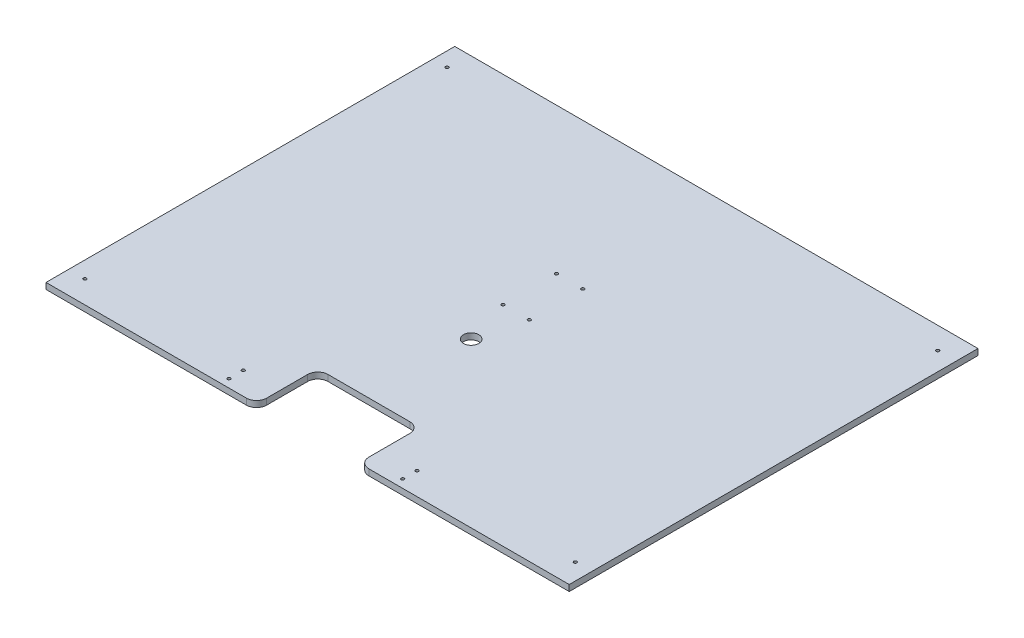
ISO-10303-21;
HEADER;
FILE_DESCRIPTION(('STEP AP214'),'2;1');
FILE_NAME('part.step','',(''),(''),'','','');
FILE_SCHEMA(('AUTOMOTIVE_DESIGN { 1 0 10303 214 1 1 1 1 }'));
ENDSEC;
DATA;
#1=APPLICATION_CONTEXT('core data for automotive mechanical design processes');
#2=APPLICATION_PROTOCOL_DEFINITION('international standard','automotive_design',2000,#1);
#3=PRODUCT_CONTEXT('',#1,'mechanical');
#4=PRODUCT('Part','Part','',(#3));
#5=PRODUCT_RELATED_PRODUCT_CATEGORY('part','',(#4));
#6=PRODUCT_DEFINITION_FORMATION('','',#4);
#7=PRODUCT_DEFINITION_CONTEXT('part definition',#1,'design');
#8=PRODUCT_DEFINITION('design','',#6,#7);
#9=PRODUCT_DEFINITION_SHAPE('','',#8);
#10=(LENGTH_UNIT() NAMED_UNIT(*) SI_UNIT(.MILLI.,.METRE.));
#11=(NAMED_UNIT(*) PLANE_ANGLE_UNIT() SI_UNIT($,.RADIAN.));
#12=(NAMED_UNIT(*) SI_UNIT($,.STERADIAN.) SOLID_ANGLE_UNIT());
#13=UNCERTAINTY_MEASURE_WITH_UNIT(LENGTH_MEASURE(1.E-05),#10,'distance_accuracy_value','');
#14=(GEOMETRIC_REPRESENTATION_CONTEXT(3) GLOBAL_UNCERTAINTY_ASSIGNED_CONTEXT((#13)) GLOBAL_UNIT_ASSIGNED_CONTEXT((#10,
#11,#12)) REPRESENTATION_CONTEXT('',''));
#15=CARTESIAN_POINT('',(0.,0.,0.));
#16=DIRECTION('',(0.,0.,1.));
#17=DIRECTION('',(1.,0.,0.));
#18=AXIS2_PLACEMENT_3D('',#15,#16,#17);
#19=CARTESIAN_POINT('',(0.,6.,0.));
#20=DIRECTION('',(0.,1.,0.));
#21=DIRECTION('',(0.,0.,1.));
#22=AXIS2_PLACEMENT_3D('',#19,#20,#21);
#23=PLANE('',#22);
#24=CARTESIAN_POINT('',(250.,6.,240.));
#25=DIRECTION('',(0.,-1.,0.));
#26=DIRECTION('',(0.,0.,-1.));
#27=AXIS2_PLACEMENT_3D('',#24,#25,#26);
#28=CIRCLE('',#27,7.50000000000001);
#29=CARTESIAN_POINT('',(250.,6.,232.5));
#30=VERTEX_POINT('',#29);
#31=EDGE_CURVE('E161',#30,#30,#28,.T.);
#32=ORIENTED_EDGE('',*,*,#31,.T.);
#33=EDGE_LOOP('',(#32));
#34=FACE_BOUND('',#33,.T.);
#35=CARTESIAN_POINT('',(165.,6.,392.));
#36=DIRECTION('',(0.,1.,0.));
#37=DIRECTION('',(0.,0.,1.));
#38=AXIS2_PLACEMENT_3D('',#35,#36,#37);
#39=CIRCLE('',#38,1.5);
#40=CARTESIAN_POINT('',(165.,6.,393.5));
#41=VERTEX_POINT('',#40);
#42=EDGE_CURVE('E187',#41,#41,#39,.T.);
#43=ORIENTED_EDGE('',*,*,#42,.F.);
#44=EDGE_LOOP('',(#43));
#45=FACE_BOUND('',#44,.T.);
#46=CARTESIAN_POINT('',(335.,6.,378.));
#47=DIRECTION('',(0.,1.,0.));
#48=DIRECTION('',(0.,0.,1.));
#49=AXIS2_PLACEMENT_3D('',#46,#47,#48);
#50=CIRCLE('',#49,1.50000000000002);
#51=CARTESIAN_POINT('',(335.,6.,379.5));
#52=VERTEX_POINT('',#51);
#53=EDGE_CURVE('E186',#52,#52,#50,.T.);
#54=ORIENTED_EDGE('',*,*,#53,.F.);
#55=EDGE_LOOP('',(#54));
#56=FACE_BOUND('',#55,.T.);
#57=CARTESIAN_POINT('',(335.,6.,392.));
#58=DIRECTION('',(0.,1.,0.));
#59=DIRECTION('',(0.,0.,1.));
#60=AXIS2_PLACEMENT_3D('',#57,#58,#59);
#61=CIRCLE('',#60,1.50000000000002);
#62=CARTESIAN_POINT('',(335.,6.,393.5));
#63=VERTEX_POINT('',#62);
#64=EDGE_CURVE('E171',#63,#63,#61,.T.);
#65=ORIENTED_EDGE('',*,*,#64,.F.);
#66=EDGE_LOOP('',(#65));
#67=FACE_BOUND('',#66,.T.);
#68=CARTESIAN_POINT('',(165.,6.,378.));
#69=DIRECTION('',(0.,1.,0.));
#70=DIRECTION('',(0.,0.,1.));
#71=AXIS2_PLACEMENT_3D('',#68,#69,#70);
#72=CIRCLE('',#71,1.5);
#73=CARTESIAN_POINT('',(165.,6.,379.5));
#74=VERTEX_POINT('',#73);
#75=EDGE_CURVE('E190',#74,#74,#72,.T.);
#76=ORIENTED_EDGE('',*,*,#75,.F.);
#77=EDGE_LOOP('',(#76));
#78=FACE_BOUND('',#77,.T.);
#79=CARTESIAN_POINT('',(8.00000000000009,6.,21.5000000000001));
#80=DIRECTION('',(0.,1.,0.));
#81=DIRECTION('',(0.,0.,1.));
#82=AXIS2_PLACEMENT_3D('',#79,#80,#81);
#83=CIRCLE('',#82,1.49999999999999);
#84=CARTESIAN_POINT('',(8.00000000000009,6.,23.0000000000001));
#85=VERTEX_POINT('',#84);
#86=EDGE_CURVE('E204',#85,#85,#83,.T.);
#87=ORIENTED_EDGE('',*,*,#86,.F.);
#88=EDGE_LOOP('',(#87));
#89=FACE_BOUND('',#88,.T.);
#90=CARTESIAN_POINT('',(262.1,6.,142.9));
#91=DIRECTION('',(0.,1.,0.));
#92=DIRECTION('',(0.,0.,1.));
#93=AXIS2_PLACEMENT_3D('',#90,#91,#92);
#94=CIRCLE('',#93,1.50000000000009);
#95=CARTESIAN_POINT('',(262.1,6.,144.4));
#96=VERTEX_POINT('',#95);
#97=EDGE_CURVE('E216',#96,#96,#94,.T.);
#98=ORIENTED_EDGE('',*,*,#97,.F.);
#99=EDGE_LOOP('',(#98));
#100=FACE_BOUND('',#99,.T.);
#101=CARTESIAN_POINT('',(236.4,6.,195.2));
#102=DIRECTION('',(0.,1.,0.));
#103=DIRECTION('',(0.,0.,1.));
#104=AXIS2_PLACEMENT_3D('',#101,#102,#103);
#105=CIRCLE('',#104,1.50000000000009);
#106=CARTESIAN_POINT('',(236.4,6.,196.7));
#107=VERTEX_POINT('',#106);
#108=EDGE_CURVE('E228',#107,#107,#105,.T.);
#109=ORIENTED_EDGE('',*,*,#108,.F.);
#110=EDGE_LOOP('',(#109));
#111=FACE_BOUND('',#110,.T.);
#112=CARTESIAN_POINT('',(490.,6.,378.));
#113=DIRECTION('',(0.,1.,0.));
#114=DIRECTION('',(0.,0.,1.));
#115=AXIS2_PLACEMENT_3D('',#112,#113,#114);
#116=CIRCLE('',#115,1.50000000000002);
#117=CARTESIAN_POINT('',(490.,6.,379.5));
#118=VERTEX_POINT('',#117);
#119=EDGE_CURVE('E240',#118,#118,#116,.T.);
#120=ORIENTED_EDGE('',*,*,#119,.F.);
#121=EDGE_LOOP('',(#120));
#122=FACE_BOUND('',#121,.T.);
#123=CARTESIAN_POINT('',(10.,6.,378.));
#124=DIRECTION('',(0.,1.,0.));
#125=DIRECTION('',(0.,0.,1.));
#126=AXIS2_PLACEMENT_3D('',#123,#124,#125);
#127=CIRCLE('',#126,1.49999999999999);
#128=CARTESIAN_POINT('',(10.,6.,379.5));
#129=VERTEX_POINT('',#128);
#130=EDGE_CURVE('E234',#129,#129,#127,.T.);
#131=ORIENTED_EDGE('',*,*,#130,.F.);
#132=EDGE_LOOP('',(#131));
#133=FACE_BOUND('',#132,.T.);
#134=CARTESIAN_POINT('',(262.1,6.,195.2));
#135=DIRECTION('',(0.,1.,0.));
#136=DIRECTION('',(0.,0.,1.));
#137=AXIS2_PLACEMENT_3D('',#134,#135,#136);
#138=CIRCLE('',#137,1.50000000000009);
#139=CARTESIAN_POINT('',(262.1,6.,196.7));
#140=VERTEX_POINT('',#139);
#141=EDGE_CURVE('E222',#140,#140,#138,.T.);
#142=ORIENTED_EDGE('',*,*,#141,.F.);
#143=EDGE_LOOP('',(#142));
#144=FACE_BOUND('',#143,.T.);
#145=CARTESIAN_POINT('',(236.4,6.,142.9));
#146=DIRECTION('',(0.,1.,0.));
#147=DIRECTION('',(0.,0.,1.));
#148=AXIS2_PLACEMENT_3D('',#145,#146,#147);
#149=CIRCLE('',#148,1.50000000000009);
#150=CARTESIAN_POINT('',(236.4,6.,144.4));
#151=VERTEX_POINT('',#150);
#152=EDGE_CURVE('E210',#151,#151,#149,.T.);
#153=ORIENTED_EDGE('',*,*,#152,.F.);
#154=EDGE_LOOP('',(#153));
#155=FACE_BOUND('',#154,.T.);
#156=CARTESIAN_POINT('',(488.,6.,21.5000000000001));
#157=DIRECTION('',(0.,1.,0.));
#158=DIRECTION('',(0.,0.,1.));
#159=AXIS2_PLACEMENT_3D('',#156,#157,#158);
#160=CIRCLE('',#159,1.52499999999998);
#161=CARTESIAN_POINT('',(488.,6.,23.0250000000001));
#162=VERTEX_POINT('',#161);
#163=EDGE_CURVE('E196',#162,#162,#160,.T.);
#164=ORIENTED_EDGE('',*,*,#163,.F.);
#165=EDGE_LOOP('',(#164));
#166=FACE_BOUND('',#165,.T.);
#167=DIRECTION('',(1.,0.,0.));
#168=VECTOR('',#167,1.);
#169=CARTESIAN_POINT('',(0.,6.,400.));
#170=LINE('',#169,#168);
#171=CARTESIAN_POINT('',(-5.99999999999997,6.00000000000006,400.));
#172=VERTEX_POINT('',#171);
#173=CARTESIAN_POINT('',(190.,6.,400.));
#174=VERTEX_POINT('',#173);
#175=EDGE_CURVE('E134',#172,#174,#170,.T.);
#176=ORIENTED_EDGE('',*,*,#175,.T.);
#177=CARTESIAN_POINT('',(190.,6.,390.));
#178=DIRECTION('',(0.,1.,0.));
#179=DIRECTION('',(0.,0.,1.));
#180=AXIS2_PLACEMENT_3D('',#177,#178,#179);
#181=CIRCLE('',#180,10.);
#182=CARTESIAN_POINT('',(200.,6.,390.));
#183=VERTEX_POINT('',#182);
#184=EDGE_CURVE('E273',#174,#183,#181,.T.);
#185=ORIENTED_EDGE('',*,*,#184,.T.);
#186=DIRECTION('',(0.,0.,1.));
#187=VECTOR('',#186,1.);
#188=CARTESIAN_POINT('',(200.,6.,0.));
#189=LINE('',#188,#187);
#190=CARTESIAN_POINT('',(200.,6.,350.));
#191=VERTEX_POINT('',#190);
#192=EDGE_CURVE('E168',#191,#183,#189,.T.);
#193=ORIENTED_EDGE('',*,*,#192,.F.);
#194=CARTESIAN_POINT('',(210.,6.,350.));
#195=DIRECTION('',(0.,1.,0.));
#196=DIRECTION('',(0.,0.,1.));
#197=AXIS2_PLACEMENT_3D('',#194,#195,#196);
#198=CIRCLE('',#197,10.);
#199=CARTESIAN_POINT('',(210.,6.,340.));
#200=VERTEX_POINT('',#199);
#201=EDGE_CURVE('E289',#191,#200,#198,.F.);
#202=ORIENTED_EDGE('',*,*,#201,.T.);
#203=DIRECTION('',(-1.,0.,0.));
#204=VECTOR('',#203,1.);
#205=CARTESIAN_POINT('',(0.,6.,340.));
#206=LINE('',#205,#204);
#207=CARTESIAN_POINT('',(290.,6.,340.));
#208=VERTEX_POINT('',#207);
#209=EDGE_CURVE('E162',#208,#200,#206,.T.);
#210=ORIENTED_EDGE('',*,*,#209,.F.);
#211=CARTESIAN_POINT('',(290.,6.,350.));
#212=DIRECTION('',(0.,1.,0.));
#213=DIRECTION('',(0.,0.,1.));
#214=AXIS2_PLACEMENT_3D('',#211,#212,#213);
#215=CIRCLE('',#214,10.);
#216=CARTESIAN_POINT('',(300.,6.,350.));
#217=VERTEX_POINT('',#216);
#218=EDGE_CURVE('E11',#208,#217,#215,.F.);
#219=ORIENTED_EDGE('',*,*,#218,.T.);
#220=DIRECTION('',(0.,0.,1.));
#221=VECTOR('',#220,1.);
#222=CARTESIAN_POINT('',(300.,6.,0.));
#223=LINE('',#222,#221);
#224=CARTESIAN_POINT('',(300.,6.,390.));
#225=VERTEX_POINT('',#224);
#226=EDGE_CURVE('E165',#217,#225,#223,.T.);
#227=ORIENTED_EDGE('',*,*,#226,.T.);
#228=CARTESIAN_POINT('',(310.,6.,390.));
#229=DIRECTION('',(0.,1.,0.));
#230=DIRECTION('',(0.,0.,1.));
#231=AXIS2_PLACEMENT_3D('',#228,#229,#230);
#232=CIRCLE('',#231,10.);
#233=CARTESIAN_POINT('',(310.,6.,400.));
#234=VERTEX_POINT('',#233);
#235=EDGE_CURVE('E48',#225,#234,#232,.T.);
#236=ORIENTED_EDGE('',*,*,#235,.T.);
#237=CARTESIAN_POINT('',(506.,6.00000000000006,400.));
#238=VERTEX_POINT('',#237);
#239=EDGE_CURVE('E139',#234,#238,#170,.T.);
#240=ORIENTED_EDGE('',*,*,#239,.T.);
#241=DIRECTION('',(0.,0.,1.));
#242=VECTOR('',#241,1.);
#243=CARTESIAN_POINT('',(506.,6.00000000000006,400.));
#244=LINE('',#243,#242);
#245=CARTESIAN_POINT('',(506.,6.00000000000001,0.));
#246=VERTEX_POINT('',#245);
#247=EDGE_CURVE('E137',#246,#238,#244,.T.);
#248=ORIENTED_EDGE('',*,*,#247,.F.);
#249=DIRECTION('',(-1.,0.,0.));
#250=VECTOR('',#249,1.);
#251=CARTESIAN_POINT('',(0.,6.,0.));
#252=LINE('',#251,#250);
#253=CARTESIAN_POINT('',(-5.99999999999992,6.00000000000001,0.));
#254=VERTEX_POINT('',#253);
#255=EDGE_CURVE('E123',#246,#254,#252,.T.);
#256=ORIENTED_EDGE('',*,*,#255,.T.);
#257=DIRECTION('',(0.,0.,-1.));
#258=VECTOR('',#257,1.);
#259=CARTESIAN_POINT('',(-5.99999999999997,6.00000000000006,400.));
#260=LINE('',#259,#258);
#261=EDGE_CURVE('E157',#172,#254,#260,.T.);
#262=ORIENTED_EDGE('',*,*,#261,.F.);
#263=EDGE_LOOP('',(#176,#185,#193,#202,#210,#219,#227,#236,#240,#248,#256,#262));
#264=FACE_BOUND('',#263,.T.);
#265=ADVANCED_FACE('F33',(#34,#45,#56,#67,#78,#89,#100,#111,#122,#133,#144,#155,#166,#264),#23,.T.);
#266=CARTESIAN_POINT('',(0.,0.,0.));
#267=DIRECTION('',(0.,1.,0.));
#268=DIRECTION('',(0.,0.,1.));
#269=AXIS2_PLACEMENT_3D('',#266,#267,#268);
#270=PLANE('',#269);
#271=CARTESIAN_POINT('',(488.,0.,21.5000000000001));
#272=DIRECTION('',(0.,1.,0.));
#273=DIRECTION('',(0.,0.,1.));
#274=AXIS2_PLACEMENT_3D('',#271,#272,#273);
#275=CIRCLE('',#274,1.52499999999998);
#276=CARTESIAN_POINT('',(488.,0.,23.0250000000001));
#277=VERTEX_POINT('',#276);
#278=EDGE_CURVE('E200',#277,#277,#275,.T.);
#279=ORIENTED_EDGE('',*,*,#278,.T.);
#280=EDGE_LOOP('',(#279));
#281=FACE_BOUND('',#280,.T.);
#282=CARTESIAN_POINT('',(8.00000000000009,0.,21.5000000000001));
#283=DIRECTION('',(0.,1.,0.));
#284=DIRECTION('',(0.,0.,1.));
#285=AXIS2_PLACEMENT_3D('',#282,#283,#284);
#286=CIRCLE('',#285,1.49999999999999);
#287=CARTESIAN_POINT('',(8.00000000000009,0.,23.0000000000001));
#288=VERTEX_POINT('',#287);
#289=EDGE_CURVE('E199',#288,#288,#286,.T.);
#290=ORIENTED_EDGE('',*,*,#289,.T.);
#291=EDGE_LOOP('',(#290));
#292=FACE_BOUND('',#291,.T.);
#293=CARTESIAN_POINT('',(236.4,0.,142.9));
#294=DIRECTION('',(0.,1.,0.));
#295=DIRECTION('',(0.,0.,1.));
#296=AXIS2_PLACEMENT_3D('',#293,#294,#295);
#297=CIRCLE('',#296,1.50000000000009);
#298=CARTESIAN_POINT('',(236.4,0.,144.4));
#299=VERTEX_POINT('',#298);
#300=EDGE_CURVE('E207',#299,#299,#297,.T.);
#301=ORIENTED_EDGE('',*,*,#300,.T.);
#302=EDGE_LOOP('',(#301));
#303=FACE_BOUND('',#302,.T.);
#304=CARTESIAN_POINT('',(262.1,0.,142.9));
#305=DIRECTION('',(0.,1.,0.));
#306=DIRECTION('',(0.,0.,1.));
#307=AXIS2_PLACEMENT_3D('',#304,#305,#306);
#308=CIRCLE('',#307,1.50000000000009);
#309=CARTESIAN_POINT('',(262.1,0.,144.4));
#310=VERTEX_POINT('',#309);
#311=EDGE_CURVE('E213',#310,#310,#308,.T.);
#312=ORIENTED_EDGE('',*,*,#311,.T.);
#313=EDGE_LOOP('',(#312));
#314=FACE_BOUND('',#313,.T.);
#315=CARTESIAN_POINT('',(262.1,0.,195.2));
#316=DIRECTION('',(0.,1.,0.));
#317=DIRECTION('',(0.,0.,1.));
#318=AXIS2_PLACEMENT_3D('',#315,#316,#317);
#319=CIRCLE('',#318,1.50000000000009);
#320=CARTESIAN_POINT('',(262.1,0.,196.7));
#321=VERTEX_POINT('',#320);
#322=EDGE_CURVE('E219',#321,#321,#319,.T.);
#323=ORIENTED_EDGE('',*,*,#322,.T.);
#324=EDGE_LOOP('',(#323));
#325=FACE_BOUND('',#324,.T.);
#326=CARTESIAN_POINT('',(236.4,0.,195.2));
#327=DIRECTION('',(0.,1.,0.));
#328=DIRECTION('',(0.,0.,1.));
#329=AXIS2_PLACEMENT_3D('',#326,#327,#328);
#330=CIRCLE('',#329,1.50000000000009);
#331=CARTESIAN_POINT('',(236.4,0.,196.7));
#332=VERTEX_POINT('',#331);
#333=EDGE_CURVE('E225',#332,#332,#330,.T.);
#334=ORIENTED_EDGE('',*,*,#333,.T.);
#335=EDGE_LOOP('',(#334));
#336=FACE_BOUND('',#335,.T.);
#337=CARTESIAN_POINT('',(10.,0.,378.));
#338=DIRECTION('',(0.,1.,0.));
#339=DIRECTION('',(0.,0.,1.));
#340=AXIS2_PLACEMENT_3D('',#337,#338,#339);
#341=CIRCLE('',#340,1.49999999999999);
#342=CARTESIAN_POINT('',(10.,0.,379.5));
#343=VERTEX_POINT('',#342);
#344=EDGE_CURVE('E231',#343,#343,#341,.T.);
#345=ORIENTED_EDGE('',*,*,#344,.T.);
#346=EDGE_LOOP('',(#345));
#347=FACE_BOUND('',#346,.T.);
#348=CARTESIAN_POINT('',(490.,0.,378.));
#349=DIRECTION('',(0.,1.,0.));
#350=DIRECTION('',(0.,0.,1.));
#351=AXIS2_PLACEMENT_3D('',#348,#349,#350);
#352=CIRCLE('',#351,1.50000000000002);
#353=CARTESIAN_POINT('',(490.,0.,379.5));
#354=VERTEX_POINT('',#353);
#355=EDGE_CURVE('E237',#354,#354,#352,.T.);
#356=ORIENTED_EDGE('',*,*,#355,.T.);
#357=EDGE_LOOP('',(#356));
#358=FACE_BOUND('',#357,.T.);
#359=CARTESIAN_POINT('',(165.,0.,378.));
#360=DIRECTION('',(0.,1.,0.));
#361=DIRECTION('',(0.,0.,1.));
#362=AXIS2_PLACEMENT_3D('',#359,#360,#361);
#363=CIRCLE('',#362,1.5);
#364=CARTESIAN_POINT('',(165.,0.,379.5));
#365=VERTEX_POINT('',#364);
#366=EDGE_CURVE('E195',#365,#365,#363,.T.);
#367=ORIENTED_EDGE('',*,*,#366,.T.);
#368=EDGE_LOOP('',(#367));
#369=FACE_BOUND('',#368,.T.);
#370=CARTESIAN_POINT('',(335.,0.,392.));
#371=DIRECTION('',(0.,1.,0.));
#372=DIRECTION('',(0.,0.,1.));
#373=AXIS2_PLACEMENT_3D('',#370,#371,#372);
#374=CIRCLE('',#373,1.50000000000002);
#375=CARTESIAN_POINT('',(335.,0.,393.5));
#376=VERTEX_POINT('',#375);
#377=EDGE_CURVE('E254',#376,#376,#374,.T.);
#378=ORIENTED_EDGE('',*,*,#377,.T.);
#379=EDGE_LOOP('',(#378));
#380=FACE_BOUND('',#379,.T.);
#381=CARTESIAN_POINT('',(335.,0.,378.));
#382=DIRECTION('',(0.,1.,0.));
#383=DIRECTION('',(0.,0.,1.));
#384=AXIS2_PLACEMENT_3D('',#381,#382,#383);
#385=CIRCLE('',#384,1.50000000000002);
#386=CARTESIAN_POINT('',(335.,0.,379.5));
#387=VERTEX_POINT('',#386);
#388=EDGE_CURVE('E257',#387,#387,#385,.T.);
#389=ORIENTED_EDGE('',*,*,#388,.T.);
#390=EDGE_LOOP('',(#389));
#391=FACE_BOUND('',#390,.T.);
#392=CARTESIAN_POINT('',(165.,0.,392.));
#393=DIRECTION('',(0.,1.,0.));
#394=DIRECTION('',(0.,0.,1.));
#395=AXIS2_PLACEMENT_3D('',#392,#393,#394);
#396=CIRCLE('',#395,1.5);
#397=CARTESIAN_POINT('',(165.,0.,393.5));
#398=VERTEX_POINT('',#397);
#399=EDGE_CURVE('E203',#398,#398,#396,.T.);
#400=ORIENTED_EDGE('',*,*,#399,.T.);
#401=EDGE_LOOP('',(#400));
#402=FACE_BOUND('',#401,.T.);
#403=CARTESIAN_POINT('',(250.,0.,240.));
#404=DIRECTION('',(0.,-1.,0.));
#405=DIRECTION('',(0.,0.,-1.));
#406=AXIS2_PLACEMENT_3D('',#403,#404,#405);
#407=CIRCLE('',#406,7.50000000000001);
#408=CARTESIAN_POINT('',(250.,0.,232.5));
#409=VERTEX_POINT('',#408);
#410=EDGE_CURVE('E176',#409,#409,#407,.T.);
#411=ORIENTED_EDGE('',*,*,#410,.F.);
#412=EDGE_LOOP('',(#411));
#413=FACE_BOUND('',#412,.T.);
#414=DIRECTION('',(0.,0.,1.));
#415=VECTOR('',#414,1.);
#416=CARTESIAN_POINT('',(200.,0.,0.));
#417=LINE('',#416,#415);
#418=CARTESIAN_POINT('',(200.,0.,350.));
#419=VERTEX_POINT('',#418);
#420=CARTESIAN_POINT('',(200.,0.,390.));
#421=VERTEX_POINT('',#420);
#422=EDGE_CURVE('E166',#419,#421,#417,.T.);
#423=ORIENTED_EDGE('',*,*,#422,.T.);
#424=CARTESIAN_POINT('',(190.,0.,390.));
#425=DIRECTION('',(0.,1.,0.));
#426=DIRECTION('',(0.,0.,1.));
#427=AXIS2_PLACEMENT_3D('',#424,#425,#426);
#428=CIRCLE('',#427,10.);
#429=CARTESIAN_POINT('',(190.,0.,400.));
#430=VERTEX_POINT('',#429);
#431=EDGE_CURVE('E268',#421,#430,#428,.F.);
#432=ORIENTED_EDGE('',*,*,#431,.T.);
#433=DIRECTION('',(1.,0.,0.));
#434=VECTOR('',#433,1.);
#435=CARTESIAN_POINT('',(0.,0.,400.));
#436=LINE('',#435,#434);
#437=CARTESIAN_POINT('',(-5.99999999999997,0.,400.));
#438=VERTEX_POINT('',#437);
#439=EDGE_CURVE('E247',#438,#430,#436,.T.);
#440=ORIENTED_EDGE('',*,*,#439,.F.);
#441=DIRECTION('',(0.,0.,-1.));
#442=VECTOR('',#441,1.);
#443=CARTESIAN_POINT('',(-5.99999999999997,0.,400.));
#444=LINE('',#443,#442);
#445=CARTESIAN_POINT('',(-5.99999999999997,0.,0.));
#446=VERTEX_POINT('',#445);
#447=EDGE_CURVE('E152',#438,#446,#444,.T.);
#448=ORIENTED_EDGE('',*,*,#447,.T.);
#449=DIRECTION('',(-1.,0.,0.));
#450=VECTOR('',#449,1.);
#451=CARTESIAN_POINT('',(0.,0.,0.));
#452=LINE('',#451,#450);
#453=CARTESIAN_POINT('',(506.,0.,0.));
#454=VERTEX_POINT('',#453);
#455=EDGE_CURVE('E250',#454,#446,#452,.T.);
#456=ORIENTED_EDGE('',*,*,#455,.F.);
#457=DIRECTION('',(0.,0.,1.));
#458=VECTOR('',#457,1.);
#459=CARTESIAN_POINT('',(506.,0.,400.));
#460=LINE('',#459,#458);
#461=CARTESIAN_POINT('',(506.,0.,400.));
#462=VERTEX_POINT('',#461);
#463=EDGE_CURVE('E147',#454,#462,#460,.T.);
#464=ORIENTED_EDGE('',*,*,#463,.T.);
#465=CARTESIAN_POINT('',(310.,0.,400.));
#466=VERTEX_POINT('',#465);
#467=EDGE_CURVE('E243',#466,#462,#436,.T.);
#468=ORIENTED_EDGE('',*,*,#467,.F.);
#469=CARTESIAN_POINT('',(310.,0.,390.));
#470=DIRECTION('',(0.,1.,0.));
#471=DIRECTION('',(0.,0.,1.));
#472=AXIS2_PLACEMENT_3D('',#469,#470,#471);
#473=CIRCLE('',#472,10.);
#474=CARTESIAN_POINT('',(300.,0.,390.));
#475=VERTEX_POINT('',#474);
#476=EDGE_CURVE('E266',#466,#475,#473,.F.);
#477=ORIENTED_EDGE('',*,*,#476,.T.);
#478=DIRECTION('',(0.,0.,1.));
#479=VECTOR('',#478,1.);
#480=CARTESIAN_POINT('',(300.,0.,0.));
#481=LINE('',#480,#479);
#482=CARTESIAN_POINT('',(300.,0.,350.));
#483=VERTEX_POINT('',#482);
#484=EDGE_CURVE('E175',#483,#475,#481,.T.);
#485=ORIENTED_EDGE('',*,*,#484,.F.);
#486=CARTESIAN_POINT('',(290.,0.,350.));
#487=DIRECTION('',(0.,1.,0.));
#488=DIRECTION('',(0.,0.,1.));
#489=AXIS2_PLACEMENT_3D('',#486,#487,#488);
#490=CIRCLE('',#489,10.);
#491=CARTESIAN_POINT('',(290.,0.,340.));
#492=VERTEX_POINT('',#491);
#493=EDGE_CURVE('E41',#483,#492,#490,.T.);
#494=ORIENTED_EDGE('',*,*,#493,.T.);
#495=DIRECTION('',(-1.,0.,0.));
#496=VECTOR('',#495,1.);
#497=CARTESIAN_POINT('',(0.,0.,340.));
#498=LINE('',#497,#496);
#499=CARTESIAN_POINT('',(210.,0.,340.));
#500=VERTEX_POINT('',#499);
#501=EDGE_CURVE('E172',#492,#500,#498,.T.);
#502=ORIENTED_EDGE('',*,*,#501,.T.);
#503=CARTESIAN_POINT('',(210.,0.,350.));
#504=DIRECTION('',(0.,1.,0.));
#505=DIRECTION('',(0.,0.,1.));
#506=AXIS2_PLACEMENT_3D('',#503,#504,#505);
#507=CIRCLE('',#506,10.);
#508=EDGE_CURVE('E287',#500,#419,#507,.T.);
#509=ORIENTED_EDGE('',*,*,#508,.T.);
#510=EDGE_LOOP('',(#423,#432,#440,#448,#456,#464,#468,#477,#485,#494,#502,#509));
#511=FACE_BOUND('',#510,.T.);
#512=ADVANCED_FACE('F293',(#281,#292,#303,#314,#325,#336,#347,#358,#369,#380,#391,#402,#413,
#511),#270,.F.);
#513=CARTESIAN_POINT('',(0.,6.,400.));
#514=DIRECTION('',(0.,0.,-1.));
#515=DIRECTION('',(-1.,0.,0.));
#516=AXIS2_PLACEMENT_3D('',#513,#514,#515);
#517=PLANE('',#516);
#518=ORIENTED_EDGE('',*,*,#439,.T.);
#519=DIRECTION('',(0.,-1.,0.));
#520=VECTOR('',#519,1.);
#521=CARTESIAN_POINT('',(190.,6.,400.));
#522=LINE('',#521,#520);
#523=EDGE_CURVE('E270',#430,#174,#522,.F.);
#524=ORIENTED_EDGE('',*,*,#523,.T.);
#525=ORIENTED_EDGE('',*,*,#175,.F.);
#526=DIRECTION('',(0.,-1.,0.));
#527=VECTOR('',#526,1.);
#528=CARTESIAN_POINT('',(-5.99999999999997,406.044997469035,400.));
#529=LINE('',#528,#527);
#530=EDGE_CURVE('E155',#172,#438,#529,.T.);
#531=ORIENTED_EDGE('',*,*,#530,.T.);
#532=EDGE_LOOP('',(#518,#524,#525,#531));
#533=FACE_BOUND('',#532,.T.);
#534=ADVANCED_FACE('F339',(#533),#517,.F.);
#535=ORIENTED_EDGE('',*,*,#239,.F.);
#536=DIRECTION('',(0.,-1.,0.));
#537=VECTOR('',#536,1.);
#538=CARTESIAN_POINT('',(310.,6.,400.));
#539=LINE('',#538,#537);
#540=EDGE_CURVE('E275',#234,#466,#539,.T.);
#541=ORIENTED_EDGE('',*,*,#540,.T.);
#542=ORIENTED_EDGE('',*,*,#467,.T.);
#543=DIRECTION('',(0.,-1.,0.));
#544=VECTOR('',#543,1.);
#545=CARTESIAN_POINT('',(506.,406.044997469035,400.));
#546=LINE('',#545,#544);
#547=EDGE_CURVE('E143',#238,#462,#546,.T.);
#548=ORIENTED_EDGE('',*,*,#547,.F.);
#549=EDGE_LOOP('',(#535,#541,#542,#548));
#550=FACE_BOUND('',#549,.T.);
#551=ADVANCED_FACE('F308',(#550),#517,.F.);
#552=CARTESIAN_POINT('',(0.,6.,0.));
#553=DIRECTION('',(0.,0.,1.));
#554=DIRECTION('',(1.,0.,0.));
#555=AXIS2_PLACEMENT_3D('',#552,#553,#554);
#556=PLANE('',#555);
#557=ORIENTED_EDGE('',*,*,#455,.T.);
#558=DIRECTION('',(0.,-1.,0.));
#559=VECTOR('',#558,1.);
#560=CARTESIAN_POINT('',(-5.99999999999997,406.044997469035,0.));
#561=LINE('',#560,#559);
#562=EDGE_CURVE('E130',#254,#446,#561,.T.);
#563=ORIENTED_EDGE('',*,*,#562,.F.);
#564=ORIENTED_EDGE('',*,*,#255,.F.);
#565=DIRECTION('',(0.,-1.,0.));
#566=VECTOR('',#565,1.);
#567=CARTESIAN_POINT('',(506.,406.044997469035,0.));
#568=LINE('',#567,#566);
#569=EDGE_CURVE('E127',#246,#454,#568,.T.);
#570=ORIENTED_EDGE('',*,*,#569,.T.);
#571=EDGE_LOOP('',(#557,#563,#564,#570));
#572=FACE_BOUND('',#571,.T.);
#573=ADVANCED_FACE('F125',(#572),#556,.F.);
#574=CARTESIAN_POINT('',(490.,6.,378.));
#575=DIRECTION('',(0.,-1.,0.));
#576=DIRECTION('',(0.,0.,-1.));
#577=AXIS2_PLACEMENT_3D('',#574,#575,#576);
#578=CYLINDRICAL_SURFACE('',#577,1.50000000000002);
#579=ORIENTED_EDGE('',*,*,#119,.T.);
#580=EDGE_LOOP('',(#579));
#581=FACE_BOUND('',#580,.T.);
#582=ORIENTED_EDGE('',*,*,#355,.F.);
#583=EDGE_LOOP('',(#582));
#584=FACE_BOUND('',#583,.T.);
#585=ADVANCED_FACE('F344',(#581,#584),#578,.F.);
#586=CARTESIAN_POINT('',(10.,6.,378.));
#587=DIRECTION('',(0.,-1.,0.));
#588=DIRECTION('',(0.,0.,-1.));
#589=AXIS2_PLACEMENT_3D('',#586,#587,#588);
#590=CYLINDRICAL_SURFACE('',#589,1.49999999999999);
#591=ORIENTED_EDGE('',*,*,#130,.T.);
#592=EDGE_LOOP('',(#591));
#593=FACE_BOUND('',#592,.T.);
#594=ORIENTED_EDGE('',*,*,#344,.F.);
#595=EDGE_LOOP('',(#594));
#596=FACE_BOUND('',#595,.T.);
#597=ADVANCED_FACE('F404',(#593,#596),#590,.F.);
#598=CARTESIAN_POINT('',(236.4,6.,195.2));
#599=DIRECTION('',(0.,-1.,0.));
#600=DIRECTION('',(0.,0.,-1.));
#601=AXIS2_PLACEMENT_3D('',#598,#599,#600);
#602=CYLINDRICAL_SURFACE('',#601,1.50000000000009);
#603=ORIENTED_EDGE('',*,*,#108,.T.);
#604=EDGE_LOOP('',(#603));
#605=FACE_BOUND('',#604,.T.);
#606=ORIENTED_EDGE('',*,*,#333,.F.);
#607=EDGE_LOOP('',(#606));
#608=FACE_BOUND('',#607,.T.);
#609=ADVANCED_FACE('F401',(#605,#608),#602,.F.);
#610=CARTESIAN_POINT('',(262.1,6.,195.2));
#611=DIRECTION('',(0.,-1.,0.));
#612=DIRECTION('',(0.,0.,-1.));
#613=AXIS2_PLACEMENT_3D('',#610,#611,#612);
#614=CYLINDRICAL_SURFACE('',#613,1.50000000000009);
#615=ORIENTED_EDGE('',*,*,#141,.T.);
#616=EDGE_LOOP('',(#615));
#617=FACE_BOUND('',#616,.T.);
#618=ORIENTED_EDGE('',*,*,#322,.F.);
#619=EDGE_LOOP('',(#618));
#620=FACE_BOUND('',#619,.T.);
#621=ADVANCED_FACE('F397',(#617,#620),#614,.F.);
#622=CARTESIAN_POINT('',(262.1,6.,142.9));
#623=DIRECTION('',(0.,-1.,0.));
#624=DIRECTION('',(0.,0.,-1.));
#625=AXIS2_PLACEMENT_3D('',#622,#623,#624);
#626=CYLINDRICAL_SURFACE('',#625,1.50000000000009);
#627=ORIENTED_EDGE('',*,*,#97,.T.);
#628=EDGE_LOOP('',(#627));
#629=FACE_BOUND('',#628,.T.);
#630=ORIENTED_EDGE('',*,*,#311,.F.);
#631=EDGE_LOOP('',(#630));
#632=FACE_BOUND('',#631,.T.);
#633=ADVANCED_FACE('F393',(#629,#632),#626,.F.);
#634=CARTESIAN_POINT('',(236.4,6.,142.9));
#635=DIRECTION('',(0.,-1.,0.));
#636=DIRECTION('',(0.,0.,-1.));
#637=AXIS2_PLACEMENT_3D('',#634,#635,#636);
#638=CYLINDRICAL_SURFACE('',#637,1.50000000000009);
#639=ORIENTED_EDGE('',*,*,#152,.T.);
#640=EDGE_LOOP('',(#639));
#641=FACE_BOUND('',#640,.T.);
#642=ORIENTED_EDGE('',*,*,#300,.F.);
#643=EDGE_LOOP('',(#642));
#644=FACE_BOUND('',#643,.T.);
#645=ADVANCED_FACE('F389',(#641,#644),#638,.F.);
#646=CARTESIAN_POINT('',(8.00000000000009,6.,21.5000000000001));
#647=DIRECTION('',(0.,-1.,0.));
#648=DIRECTION('',(0.,0.,-1.));
#649=AXIS2_PLACEMENT_3D('',#646,#647,#648);
#650=CYLINDRICAL_SURFACE('',#649,1.49999999999999);
#651=ORIENTED_EDGE('',*,*,#86,.T.);
#652=EDGE_LOOP('',(#651));
#653=FACE_BOUND('',#652,.T.);
#654=ORIENTED_EDGE('',*,*,#289,.F.);
#655=EDGE_LOOP('',(#654));
#656=FACE_BOUND('',#655,.T.);
#657=ADVANCED_FACE('F385',(#653,#656),#650,.F.);
#658=CARTESIAN_POINT('',(488.,6.,21.5000000000001));
#659=DIRECTION('',(0.,-1.,0.));
#660=DIRECTION('',(0.,0.,-1.));
#661=AXIS2_PLACEMENT_3D('',#658,#659,#660);
#662=CYLINDRICAL_SURFACE('',#661,1.52499999999998);
#663=ORIENTED_EDGE('',*,*,#163,.T.);
#664=EDGE_LOOP('',(#663));
#665=FACE_BOUND('',#664,.T.);
#666=ORIENTED_EDGE('',*,*,#278,.F.);
#667=EDGE_LOOP('',(#666));
#668=FACE_BOUND('',#667,.T.);
#669=ADVANCED_FACE('F381',(#665,#668),#662,.F.);
#670=CARTESIAN_POINT('',(165.,-4.,378.));
#671=DIRECTION('',(0.,1.,0.));
#672=DIRECTION('',(0.,0.,1.));
#673=AXIS2_PLACEMENT_3D('',#670,#671,#672);
#674=CYLINDRICAL_SURFACE('',#673,1.5);
#675=ORIENTED_EDGE('',*,*,#75,.T.);
#676=EDGE_LOOP('',(#675));
#677=FACE_BOUND('',#676,.T.);
#678=ORIENTED_EDGE('',*,*,#366,.F.);
#679=EDGE_LOOP('',(#678));
#680=FACE_BOUND('',#679,.T.);
#681=ADVANCED_FACE('F370',(#677,#680),#674,.F.);
#682=CARTESIAN_POINT('',(335.,-4.,392.));
#683=DIRECTION('',(0.,1.,0.));
#684=DIRECTION('',(0.,0.,1.));
#685=AXIS2_PLACEMENT_3D('',#682,#683,#684);
#686=CYLINDRICAL_SURFACE('',#685,1.50000000000002);
#687=ORIENTED_EDGE('',*,*,#64,.T.);
#688=EDGE_LOOP('',(#687));
#689=FACE_BOUND('',#688,.T.);
#690=ORIENTED_EDGE('',*,*,#377,.F.);
#691=EDGE_LOOP('',(#690));
#692=FACE_BOUND('',#691,.T.);
#693=ADVANCED_FACE('F366',(#689,#692),#686,.F.);
#694=CARTESIAN_POINT('',(335.,-4.,378.));
#695=DIRECTION('',(0.,1.,0.));
#696=DIRECTION('',(0.,0.,1.));
#697=AXIS2_PLACEMENT_3D('',#694,#695,#696);
#698=CYLINDRICAL_SURFACE('',#697,1.50000000000002);
#699=ORIENTED_EDGE('',*,*,#53,.T.);
#700=EDGE_LOOP('',(#699));
#701=FACE_BOUND('',#700,.T.);
#702=ORIENTED_EDGE('',*,*,#388,.F.);
#703=EDGE_LOOP('',(#702));
#704=FACE_BOUND('',#703,.T.);
#705=ADVANCED_FACE('F369',(#701,#704),#698,.F.);
#706=CARTESIAN_POINT('',(165.,-4.,392.));
#707=DIRECTION('',(0.,1.,0.));
#708=DIRECTION('',(0.,0.,1.));
#709=AXIS2_PLACEMENT_3D('',#706,#707,#708);
#710=CYLINDRICAL_SURFACE('',#709,1.5);
#711=ORIENTED_EDGE('',*,*,#42,.T.);
#712=EDGE_LOOP('',(#711));
#713=FACE_BOUND('',#712,.T.);
#714=ORIENTED_EDGE('',*,*,#399,.F.);
#715=EDGE_LOOP('',(#714));
#716=FACE_BOUND('',#715,.T.);
#717=ADVANCED_FACE('F372',(#713,#716),#710,.F.);
#718=CARTESIAN_POINT('',(0.,6.,340.));
#719=DIRECTION('',(0.,0.,1.));
#720=DIRECTION('',(1.,0.,0.));
#721=AXIS2_PLACEMENT_3D('',#718,#719,#720);
#722=PLANE('',#721);
#723=ORIENTED_EDGE('',*,*,#209,.T.);
#724=DIRECTION('',(0.,-1.,0.));
#725=VECTOR('',#724,1.);
#726=CARTESIAN_POINT('',(210.,0.,340.));
#727=LINE('',#726,#725);
#728=EDGE_CURVE('E284',#200,#500,#727,.T.);
#729=ORIENTED_EDGE('',*,*,#728,.T.);
#730=ORIENTED_EDGE('',*,*,#501,.F.);
#731=DIRECTION('',(0.,-1.,0.));
#732=VECTOR('',#731,1.);
#733=CARTESIAN_POINT('',(290.,6.,340.));
#734=LINE('',#733,#732);
#735=EDGE_CURVE('E282',#492,#208,#734,.F.);
#736=ORIENTED_EDGE('',*,*,#735,.T.);
#737=EDGE_LOOP('',(#723,#729,#730,#736));
#738=FACE_BOUND('',#737,.T.);
#739=ADVANCED_FACE('F298',(#738),#722,.T.);
#740=CARTESIAN_POINT('',(200.,6.,0.));
#741=DIRECTION('',(1.,0.,0.));
#742=DIRECTION('',(0.,0.,-1.));
#743=AXIS2_PLACEMENT_3D('',#740,#741,#742);
#744=PLANE('',#743);
#745=ORIENTED_EDGE('',*,*,#192,.T.);
#746=DIRECTION('',(0.,-1.,0.));
#747=VECTOR('',#746,1.);
#748=CARTESIAN_POINT('',(200.,0.,390.));
#749=LINE('',#748,#747);
#750=EDGE_CURVE('E263',#183,#421,#749,.T.);
#751=ORIENTED_EDGE('',*,*,#750,.T.);
#752=ORIENTED_EDGE('',*,*,#422,.F.);
#753=DIRECTION('',(0.,-1.,0.));
#754=VECTOR('',#753,1.);
#755=CARTESIAN_POINT('',(200.,6.,350.));
#756=LINE('',#755,#754);
#757=EDGE_CURVE('E133',#419,#191,#756,.F.);
#758=ORIENTED_EDGE('',*,*,#757,.T.);
#759=EDGE_LOOP('',(#745,#751,#752,#758));
#760=FACE_BOUND('',#759,.T.);
#761=ADVANCED_FACE('F322',(#760),#744,.T.);
#762=CARTESIAN_POINT('',(300.,6.,0.));
#763=DIRECTION('',(1.,0.,0.));
#764=DIRECTION('',(0.,0.,-1.));
#765=AXIS2_PLACEMENT_3D('',#762,#763,#764);
#766=PLANE('',#765);
#767=ORIENTED_EDGE('',*,*,#484,.T.);
#768=DIRECTION('',(0.,-1.,0.));
#769=VECTOR('',#768,1.);
#770=CARTESIAN_POINT('',(300.,6.,390.));
#771=LINE('',#770,#769);
#772=EDGE_CURVE('E56',#475,#225,#771,.F.);
#773=ORIENTED_EDGE('',*,*,#772,.T.);
#774=ORIENTED_EDGE('',*,*,#226,.F.);
#775=DIRECTION('',(0.,-1.,0.));
#776=VECTOR('',#775,1.);
#777=CARTESIAN_POINT('',(300.,6.,350.));
#778=LINE('',#777,#776);
#779=EDGE_CURVE('E278',#217,#483,#778,.T.);
#780=ORIENTED_EDGE('',*,*,#779,.T.);
#781=EDGE_LOOP('',(#767,#773,#774,#780));
#782=FACE_BOUND('',#781,.T.);
#783=ADVANCED_FACE('F302',(#782),#766,.F.);
#784=CARTESIAN_POINT('',(250.,6.,240.));
#785=DIRECTION('',(0.,-1.,0.));
#786=DIRECTION('',(0.,0.,-1.));
#787=AXIS2_PLACEMENT_3D('',#784,#785,#786);
#788=CYLINDRICAL_SURFACE('',#787,7.50000000000001);
#789=ORIENTED_EDGE('',*,*,#31,.F.);
#790=EDGE_LOOP('',(#789));
#791=FACE_BOUND('',#790,.T.);
#792=ORIENTED_EDGE('',*,*,#410,.T.);
#793=EDGE_LOOP('',(#792));
#794=FACE_BOUND('',#793,.T.);
#795=ADVANCED_FACE('F352',(#791,#794),#788,.F.);
#796=CARTESIAN_POINT('',(190.,6.,390.));
#797=DIRECTION('',(0.,1.,0.));
#798=DIRECTION('',(0.,0.,1.));
#799=AXIS2_PLACEMENT_3D('',#796,#797,#798);
#800=CYLINDRICAL_SURFACE('',#799,10.);
#801=ORIENTED_EDGE('',*,*,#184,.F.);
#802=ORIENTED_EDGE('',*,*,#523,.F.);
#803=ORIENTED_EDGE('',*,*,#431,.F.);
#804=ORIENTED_EDGE('',*,*,#750,.F.);
#805=EDGE_LOOP('',(#801,#802,#803,#804));
#806=FACE_BOUND('',#805,.T.);
#807=ADVANCED_FACE('F319',(#806),#800,.T.);
#808=CARTESIAN_POINT('',(310.,6.,390.));
#809=DIRECTION('',(0.,-1.,0.));
#810=DIRECTION('',(0.,0.,-1.));
#811=AXIS2_PLACEMENT_3D('',#808,#809,#810);
#812=CYLINDRICAL_SURFACE('',#811,10.);
#813=ORIENTED_EDGE('',*,*,#235,.F.);
#814=ORIENTED_EDGE('',*,*,#772,.F.);
#815=ORIENTED_EDGE('',*,*,#476,.F.);
#816=ORIENTED_EDGE('',*,*,#540,.F.);
#817=EDGE_LOOP('',(#813,#814,#815,#816));
#818=FACE_BOUND('',#817,.T.);
#819=ADVANCED_FACE('F304',(#818),#812,.T.);
#820=CARTESIAN_POINT('',(210.,6.,350.));
#821=DIRECTION('',(0.,1.,0.));
#822=DIRECTION('',(0.,0.,1.));
#823=AXIS2_PLACEMENT_3D('',#820,#821,#822);
#824=CYLINDRICAL_SURFACE('',#823,10.);
#825=ORIENTED_EDGE('',*,*,#201,.F.);
#826=ORIENTED_EDGE('',*,*,#757,.F.);
#827=ORIENTED_EDGE('',*,*,#508,.F.);
#828=ORIENTED_EDGE('',*,*,#728,.F.);
#829=EDGE_LOOP('',(#825,#826,#827,#828));
#830=FACE_BOUND('',#829,.T.);
#831=ADVANCED_FACE('F326',(#830),#824,.F.);
#832=CARTESIAN_POINT('',(290.,6.,350.));
#833=DIRECTION('',(0.,-1.,0.));
#834=DIRECTION('',(0.,0.,-1.));
#835=AXIS2_PLACEMENT_3D('',#832,#833,#834);
#836=CYLINDRICAL_SURFACE('',#835,10.);
#837=ORIENTED_EDGE('',*,*,#218,.F.);
#838=ORIENTED_EDGE('',*,*,#735,.F.);
#839=ORIENTED_EDGE('',*,*,#493,.F.);
#840=ORIENTED_EDGE('',*,*,#779,.F.);
#841=EDGE_LOOP('',(#837,#838,#839,#840));
#842=FACE_BOUND('',#841,.T.);
#843=ADVANCED_FACE('F35',(#842),#836,.F.);
#844=CARTESIAN_POINT('',(-5.99999999999997,406.044997469035,400.));
#845=DIRECTION('',(-1.,0.,0.));
#846=DIRECTION('',(0.,0.,1.));
#847=AXIS2_PLACEMENT_3D('',#844,#845,#846);
#848=PLANE('',#847);
#849=ORIENTED_EDGE('',*,*,#530,.F.);
#850=ORIENTED_EDGE('',*,*,#261,.T.);
#851=ORIENTED_EDGE('',*,*,#562,.T.);
#852=ORIENTED_EDGE('',*,*,#447,.F.);
#853=EDGE_LOOP('',(#849,#850,#851,#852));
#854=FACE_BOUND('',#853,.T.);
#855=ADVANCED_FACE('F312',(#854),#848,.T.);
#856=CARTESIAN_POINT('',(506.,406.044997469035,400.));
#857=DIRECTION('',(1.,0.,0.));
#858=DIRECTION('',(0.,0.,-1.));
#859=AXIS2_PLACEMENT_3D('',#856,#857,#858);
#860=PLANE('',#859);
#861=ORIENTED_EDGE('',*,*,#569,.F.);
#862=ORIENTED_EDGE('',*,*,#247,.T.);
#863=ORIENTED_EDGE('',*,*,#547,.T.);
#864=ORIENTED_EDGE('',*,*,#463,.F.);
#865=EDGE_LOOP('',(#861,#862,#863,#864));
#866=FACE_BOUND('',#865,.T.);
#867=ADVANCED_FACE('F145',(#866),#860,.T.);
#868=CLOSED_SHELL('',(#265,#512,#534,#551,#573,#585,#597,#609,#621,#633,#645,#657,#669,#681,
#693,#705,#717,#739,#761,#783,#795,#807,#819,#831,#843,#855,#867));
#869=MANIFOLD_SOLID_BREP('B2',#868);
#870=ADVANCED_BREP_SHAPE_REPRESENTATION('',(#18,#869),#14);
#871=SHAPE_DEFINITION_REPRESENTATION(#9,#870);
ENDSEC;
END-ISO-10303-21;
